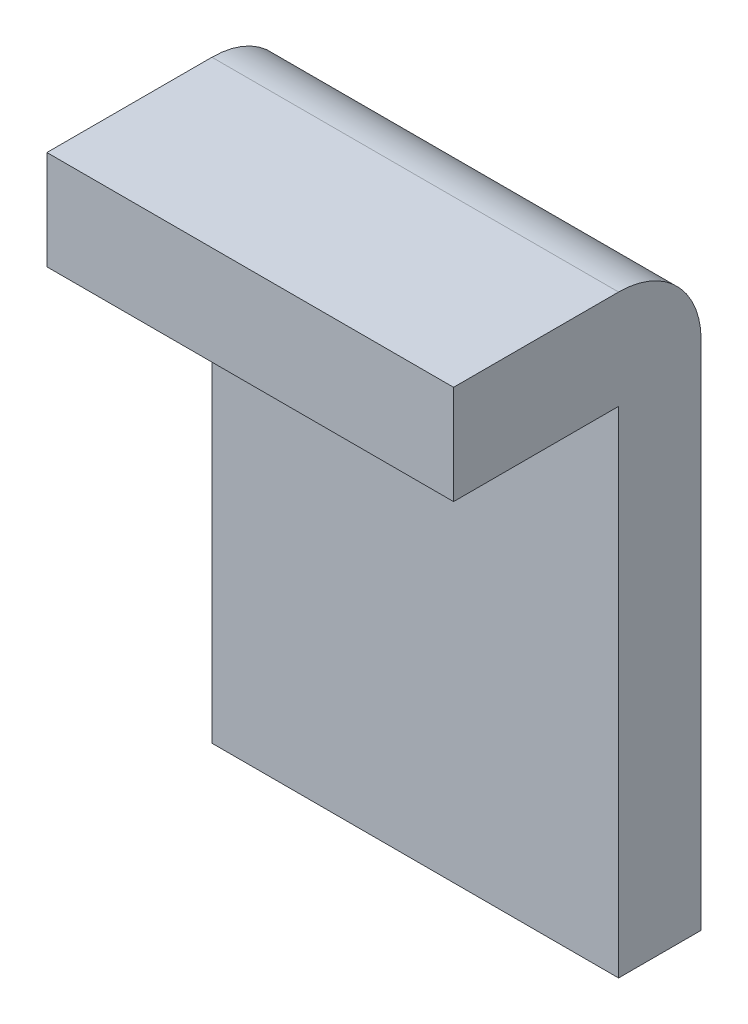
ISO-10303-21;
HEADER;
FILE_DESCRIPTION(('STEP AP214'),'2;1');
FILE_NAME('part.step','',(''),(''),'','','');
FILE_SCHEMA(('AUTOMOTIVE_DESIGN { 1 0 10303 214 1 1 1 1 }'));
ENDSEC;
DATA;
#1=APPLICATION_CONTEXT('core data for automotive mechanical design processes');
#2=APPLICATION_PROTOCOL_DEFINITION('international standard','automotive_design',2000,#1);
#3=PRODUCT_CONTEXT('',#1,'mechanical');
#4=PRODUCT('Part','Part','',(#3));
#5=PRODUCT_RELATED_PRODUCT_CATEGORY('part','',(#4));
#6=PRODUCT_DEFINITION_FORMATION('','',#4);
#7=PRODUCT_DEFINITION_CONTEXT('part definition',#1,'design');
#8=PRODUCT_DEFINITION('design','',#6,#7);
#9=PRODUCT_DEFINITION_SHAPE('','',#8);
#10=(LENGTH_UNIT() NAMED_UNIT(*) SI_UNIT(.MILLI.,.METRE.));
#11=(NAMED_UNIT(*) PLANE_ANGLE_UNIT() SI_UNIT($,.RADIAN.));
#12=(NAMED_UNIT(*) SI_UNIT($,.STERADIAN.) SOLID_ANGLE_UNIT());
#13=UNCERTAINTY_MEASURE_WITH_UNIT(LENGTH_MEASURE(1.E-05),#10,'distance_accuracy_value','');
#14=(GEOMETRIC_REPRESENTATION_CONTEXT(3) GLOBAL_UNCERTAINTY_ASSIGNED_CONTEXT((#13)) GLOBAL_UNIT_ASSIGNED_CONTEXT((#10,
#11,#12)) REPRESENTATION_CONTEXT('',''));
#15=CARTESIAN_POINT('',(0.,0.,0.));
#16=DIRECTION('',(0.,0.,1.));
#17=DIRECTION('',(1.,0.,0.));
#18=AXIS2_PLACEMENT_3D('',#15,#16,#17);
#19=CARTESIAN_POINT('',(-8.34906661620967,8.30000000000001,4.25467377707551));
#20=DIRECTION('',(0.,1.,0.));
#21=DIRECTION('',(0.,0.,1.));
#22=AXIS2_PLACEMENT_3D('',#19,#20,#21);
#23=PLANE('',#22);
#24=DIRECTION('',(1.,0.,0.));
#25=VECTOR('',#24,1.);
#26=CARTESIAN_POINT('',(1.63654353343393,8.30000000000001,4.25467377707552));
#27=LINE('',#26,#25);
#28=CARTESIAN_POINT('',(1.63654353343393,8.30000000000001,4.25467377707551));
#29=VERTEX_POINT('',#28);
#30=CARTESIAN_POINT('',(2.86869428987466,8.30000000000001,4.25467377707551));
#31=VERTEX_POINT('',#30);
#32=EDGE_CURVE('E133',#29,#31,#27,.T.);
#33=ORIENTED_EDGE('',*,*,#32,.F.);
#34=DIRECTION('',(0.,0.,1.));
#35=VECTOR('',#34,1.);
#36=CARTESIAN_POINT('',(1.63654353343393,8.30000000000001,4.25467377707553));
#37=LINE('',#36,#35);
#38=CARTESIAN_POINT('',(1.63654353343393,8.30000000000001,3.75467377707551));
#39=VERTEX_POINT('',#38);
#40=EDGE_CURVE('E113',#39,#29,#37,.T.);
#41=ORIENTED_EDGE('',*,*,#40,.F.);
#42=DIRECTION('',(1.,0.,0.));
#43=VECTOR('',#42,1.);
#44=CARTESIAN_POINT('',(-8.34906661620967,8.30000000000001,3.75467377707551));
#45=LINE('',#44,#43);
#46=CARTESIAN_POINT('',(2.86869428987466,8.30000000000001,3.75467377707551));
#47=VERTEX_POINT('',#46);
#48=EDGE_CURVE('E130',#39,#47,#45,.T.);
#49=ORIENTED_EDGE('',*,*,#48,.T.);
#50=DIRECTION('',(0.,0.,-1.));
#51=VECTOR('',#50,1.);
#52=CARTESIAN_POINT('',(2.86869428987466,8.30000000000001,4.25467377707553));
#53=LINE('',#52,#51);
#54=EDGE_CURVE('E129',#31,#47,#53,.T.);
#55=ORIENTED_EDGE('',*,*,#54,.F.);
#56=EDGE_LOOP('',(#33,#41,#49,#55));
#57=FACE_BOUND('',#56,.T.);
#58=ADVANCED_FACE('F17',(#57),#23,.F.);
#59=CARTESIAN_POINT('',(1.63654353343393,5.35753839337144,4.25467377707553));
#60=DIRECTION('',(0.,0.,1.));
#61=DIRECTION('',(0.,-1.,0.));
#62=AXIS2_PLACEMENT_3D('',#59,#60,#61);
#63=PLANE('',#62);
#64=DIRECTION('',(1.,0.,0.));
#65=VECTOR('',#64,1.);
#66=CARTESIAN_POINT('',(-8.34906661620967,8.6,4.25467377707551));
#67=LINE('',#66,#65);
#68=CARTESIAN_POINT('',(2.86869428987466,8.6,4.25467377707551));
#69=VERTEX_POINT('',#68);
#70=CARTESIAN_POINT('',(1.63654353343393,8.6,4.25467377707551));
#71=VERTEX_POINT('',#70);
#72=EDGE_CURVE('E131',#69,#71,#67,.F.);
#73=ORIENTED_EDGE('',*,*,#72,.T.);
#74=DIRECTION('',(0.,1.,0.));
#75=VECTOR('',#74,1.);
#76=CARTESIAN_POINT('',(1.63654353343393,5.35753839337144,4.25467377707551));
#77=LINE('',#76,#75);
#78=EDGE_CURVE('E136',#29,#71,#77,.T.);
#79=ORIENTED_EDGE('',*,*,#78,.F.);
#80=ORIENTED_EDGE('',*,*,#32,.T.);
#81=DIRECTION('',(0.,1.,0.));
#82=VECTOR('',#81,1.);
#83=CARTESIAN_POINT('',(2.86869428987466,5.35753839337144,4.25467377707551));
#84=LINE('',#83,#82);
#85=EDGE_CURVE('E120',#69,#31,#84,.F.);
#86=ORIENTED_EDGE('',*,*,#85,.F.);
#87=EDGE_LOOP('',(#73,#79,#80,#86));
#88=FACE_BOUND('',#87,.T.);
#89=ADVANCED_FACE('F172',(#88),#63,.T.);
#90=CARTESIAN_POINT('',(-8.34906661620967,8.6,4.25467377707551));
#91=DIRECTION('',(0.,-1.,0.));
#92=DIRECTION('',(0.,0.,-1.));
#93=AXIS2_PLACEMENT_3D('',#90,#91,#92);
#94=PLANE('',#93);
#95=DIRECTION('',(1.,0.,0.));
#96=VECTOR('',#95,1.);
#97=CARTESIAN_POINT('',(-8.34906661620967,8.6,3.75467377707551));
#98=LINE('',#97,#96);
#99=CARTESIAN_POINT('',(1.63654353343393,8.6,3.7546737770755));
#100=VERTEX_POINT('',#99);
#101=CARTESIAN_POINT('',(2.86869428987466,8.6,3.7546737770755));
#102=VERTEX_POINT('',#101);
#103=EDGE_CURVE('E79',#100,#102,#98,.T.);
#104=ORIENTED_EDGE('',*,*,#103,.F.);
#105=DIRECTION('',(0.,0.,1.));
#106=VECTOR('',#105,1.);
#107=CARTESIAN_POINT('',(1.63654353343393,8.6,4.25467377707553));
#108=LINE('',#107,#106);
#109=EDGE_CURVE('E139',#71,#100,#108,.F.);
#110=ORIENTED_EDGE('',*,*,#109,.F.);
#111=ORIENTED_EDGE('',*,*,#72,.F.);
#112=DIRECTION('',(0.,0.,-1.));
#113=VECTOR('',#112,1.);
#114=CARTESIAN_POINT('',(2.86869428987466,8.6,4.25467377707553));
#115=LINE('',#114,#113);
#116=EDGE_CURVE('E83',#102,#69,#115,.F.);
#117=ORIENTED_EDGE('',*,*,#116,.F.);
#118=EDGE_LOOP('',(#104,#110,#111,#117));
#119=FACE_BOUND('',#118,.T.);
#120=ADVANCED_FACE('F169',(#119),#94,.F.);
#121=CARTESIAN_POINT('',(-8.34906661620967,8.30000000000001,3.75467377707551));
#122=DIRECTION('',(0.,0.,-1.));
#123=DIRECTION('',(0.,1.,0.));
#124=AXIS2_PLACEMENT_3D('',#121,#122,#123);
#125=PLANE('',#124);
#126=ORIENTED_EDGE('',*,*,#48,.F.);
#127=DIRECTION('',(0.,1.,0.));
#128=VECTOR('',#127,1.);
#129=CARTESIAN_POINT('',(1.63654353343393,5.35753839337144,3.75467377707551));
#130=LINE('',#129,#128);
#131=CARTESIAN_POINT('',(1.63654353343393,6.8,3.75467377707551));
#132=VERTEX_POINT('',#131);
#133=EDGE_CURVE('E95',#132,#39,#130,.T.);
#134=ORIENTED_EDGE('',*,*,#133,.F.);
#135=DIRECTION('',(1.,0.,0.));
#136=VECTOR('',#135,1.);
#137=CARTESIAN_POINT('',(-15.8147962412963,6.8,3.75467377707551));
#138=LINE('',#137,#136);
#139=CARTESIAN_POINT('',(2.86869428987466,6.8,3.75467377707551));
#140=VERTEX_POINT('',#139);
#141=EDGE_CURVE('E114',#140,#132,#138,.F.);
#142=ORIENTED_EDGE('',*,*,#141,.F.);
#143=DIRECTION('',(0.,1.,0.));
#144=VECTOR('',#143,1.);
#145=CARTESIAN_POINT('',(2.86869428987466,5.35753839337144,3.75467377707551));
#146=LINE('',#145,#144);
#147=EDGE_CURVE('E84',#47,#140,#146,.F.);
#148=ORIENTED_EDGE('',*,*,#147,.F.);
#149=EDGE_LOOP('',(#126,#134,#142,#148));
#150=FACE_BOUND('',#149,.T.);
#151=ADVANCED_FACE('F178',(#150),#125,.F.);
#152=CARTESIAN_POINT('',(-8.34906661620967,8.35,3.7546737770755));
#153=DIRECTION('',(1.,0.,0.));
#154=DIRECTION('',(0.,0.,-1.));
#155=AXIS2_PLACEMENT_3D('',#152,#153,#154);
#156=CYLINDRICAL_SURFACE('',#155,0.249999999999996);
#157=CARTESIAN_POINT('',(1.63654353343393,8.35,3.7546737770755));
#158=DIRECTION('',(1.,0.,0.));
#159=DIRECTION('',(0.,0.,-1.));
#160=AXIS2_PLACEMENT_3D('',#157,#158,#159);
#161=CIRCLE('',#160,0.249999999999996);
#162=CARTESIAN_POINT('',(1.63654353343393,8.35,3.50467377707551));
#163=VERTEX_POINT('',#162);
#164=EDGE_CURVE('E106',#100,#163,#161,.F.);
#165=ORIENTED_EDGE('',*,*,#164,.F.);
#166=ORIENTED_EDGE('',*,*,#103,.T.);
#167=CARTESIAN_POINT('',(2.86869428987466,8.35,3.7546737770755));
#168=DIRECTION('',(1.,0.,0.));
#169=DIRECTION('',(0.,0.,-1.));
#170=AXIS2_PLACEMENT_3D('',#167,#168,#169);
#171=CIRCLE('',#170,0.249999999999996);
#172=CARTESIAN_POINT('',(2.86869428987466,8.35,3.50467377707551));
#173=VERTEX_POINT('',#172);
#174=EDGE_CURVE('E20',#173,#102,#171,.T.);
#175=ORIENTED_EDGE('',*,*,#174,.F.);
#176=DIRECTION('',(1.,0.,0.));
#177=VECTOR('',#176,1.);
#178=CARTESIAN_POINT('',(1.63654353343393,8.35,3.50467377707551));
#179=LINE('',#178,#177);
#180=EDGE_CURVE('E77',#163,#173,#179,.T.);
#181=ORIENTED_EDGE('',*,*,#180,.F.);
#182=EDGE_LOOP('',(#165,#166,#175,#181));
#183=FACE_BOUND('',#182,.T.);
#184=ADVANCED_FACE('F75',(#183),#156,.T.);
#185=CARTESIAN_POINT('',(2.86869428987466,5.35753839337144,4.25467377707553));
#186=DIRECTION('',(1.,0.,0.));
#187=DIRECTION('',(0.,0.,-1.));
#188=AXIS2_PLACEMENT_3D('',#185,#186,#187);
#189=PLANE('',#188);
#190=ORIENTED_EDGE('',*,*,#116,.T.);
#191=ORIENTED_EDGE('',*,*,#85,.T.);
#192=ORIENTED_EDGE('',*,*,#54,.T.);
#193=ORIENTED_EDGE('',*,*,#147,.T.);
#194=DIRECTION('',(0.,0.,-1.));
#195=VECTOR('',#194,1.);
#196=CARTESIAN_POINT('',(2.86869428987466,6.80000000000003,12.5046737770755));
#197=LINE('',#196,#195);
#198=CARTESIAN_POINT('',(2.86869428987466,6.8,3.50467377707552));
#199=VERTEX_POINT('',#198);
#200=EDGE_CURVE('E90',#199,#140,#197,.F.);
#201=ORIENTED_EDGE('',*,*,#200,.F.);
#202=DIRECTION('',(0.,1.,0.));
#203=VECTOR('',#202,1.);
#204=CARTESIAN_POINT('',(2.86869428987466,5.35753839337143,3.50467377707553));
#205=LINE('',#204,#203);
#206=EDGE_CURVE('E86',#173,#199,#205,.F.);
#207=ORIENTED_EDGE('',*,*,#206,.F.);
#208=ORIENTED_EDGE('',*,*,#174,.T.);
#209=EDGE_LOOP('',(#190,#191,#192,#193,#201,#207,#208));
#210=FACE_BOUND('',#209,.T.);
#211=ADVANCED_FACE('F87',(#210),#189,.T.);
#212=CARTESIAN_POINT('',(-15.8147962412963,6.80000000000003,12.5046737770755));
#213=DIRECTION('',(0.,-1.,0.));
#214=DIRECTION('',(0.,0.,-1.));
#215=AXIS2_PLACEMENT_3D('',#212,#213,#214);
#216=PLANE('',#215);
#217=DIRECTION('',(1.,0.,0.));
#218=VECTOR('',#217,1.);
#219=CARTESIAN_POINT('',(1.63654353343393,6.8,3.50467377707552));
#220=LINE('',#219,#218);
#221=CARTESIAN_POINT('',(1.63654353343393,6.8,3.50467377707552));
#222=VERTEX_POINT('',#221);
#223=EDGE_CURVE('E26',#199,#222,#220,.F.);
#224=ORIENTED_EDGE('',*,*,#223,.F.);
#225=ORIENTED_EDGE('',*,*,#200,.T.);
#226=ORIENTED_EDGE('',*,*,#141,.T.);
#227=DIRECTION('',(0.,0.,1.));
#228=VECTOR('',#227,1.);
#229=CARTESIAN_POINT('',(1.63654353343393,6.8,4.25467377707553));
#230=LINE('',#229,#228);
#231=EDGE_CURVE('E35',#222,#132,#230,.T.);
#232=ORIENTED_EDGE('',*,*,#231,.F.);
#233=EDGE_LOOP('',(#224,#225,#226,#232));
#234=FACE_BOUND('',#233,.T.);
#235=ADVANCED_FACE('F179',(#234),#216,.T.);
#236=CARTESIAN_POINT('',(1.63654353343393,5.35753839337144,4.25467377707553));
#237=DIRECTION('',(-1.,0.,0.));
#238=DIRECTION('',(0.,0.,1.));
#239=AXIS2_PLACEMENT_3D('',#236,#237,#238);
#240=PLANE('',#239);
#241=ORIENTED_EDGE('',*,*,#231,.T.);
#242=ORIENTED_EDGE('',*,*,#133,.T.);
#243=ORIENTED_EDGE('',*,*,#40,.T.);
#244=ORIENTED_EDGE('',*,*,#78,.T.);
#245=ORIENTED_EDGE('',*,*,#109,.T.);
#246=ORIENTED_EDGE('',*,*,#164,.T.);
#247=DIRECTION('',(0.,1.,0.));
#248=VECTOR('',#247,1.);
#249=CARTESIAN_POINT('',(1.63654353343393,5.35753839337143,3.50467377707553));
#250=LINE('',#249,#248);
#251=EDGE_CURVE('E11',#222,#163,#250,.T.);
#252=ORIENTED_EDGE('',*,*,#251,.F.);
#253=EDGE_LOOP('',(#241,#242,#243,#244,#245,#246,#252));
#254=FACE_BOUND('',#253,.T.);
#255=ADVANCED_FACE('F166',(#254),#240,.T.);
#256=CARTESIAN_POINT('',(1.63654353343393,5.35753839337143,3.50467377707553));
#257=DIRECTION('',(0.,0.,-1.));
#258=DIRECTION('',(0.,1.,0.));
#259=AXIS2_PLACEMENT_3D('',#256,#257,#258);
#260=PLANE('',#259);
#261=ORIENTED_EDGE('',*,*,#223,.T.);
#262=ORIENTED_EDGE('',*,*,#251,.T.);
#263=ORIENTED_EDGE('',*,*,#180,.T.);
#264=ORIENTED_EDGE('',*,*,#206,.T.);
#265=EDGE_LOOP('',(#261,#262,#263,#264));
#266=FACE_BOUND('',#265,.T.);
#267=ADVANCED_FACE('F94',(#266),#260,.T.);
#268=CLOSED_SHELL('',(#58,#89,#120,#151,#184,#211,#235,#255,#267));
#269=MANIFOLD_SOLID_BREP('B1',#268);
#270=ADVANCED_BREP_SHAPE_REPRESENTATION('',(#18,#269),#14);
#271=SHAPE_DEFINITION_REPRESENTATION(#9,#270);
ENDSEC;
END-ISO-10303-21;
